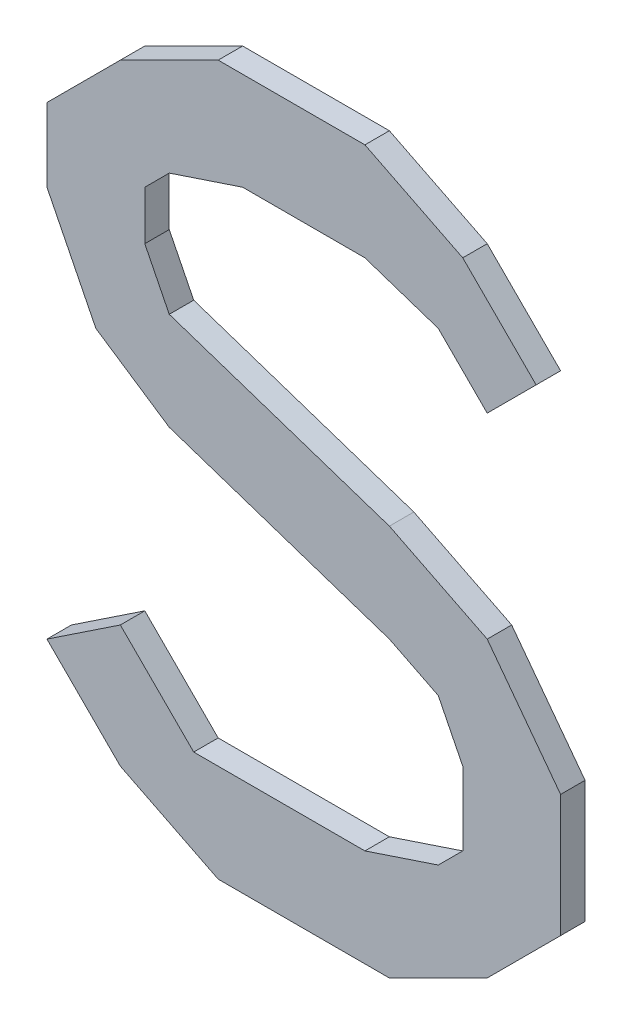
ISO-10303-21;
HEADER;
FILE_DESCRIPTION(('STEP AP214'),'2;1');
FILE_NAME('part.step','',(''),(''),'','','');
FILE_SCHEMA(('AUTOMOTIVE_DESIGN { 1 0 10303 214 1 1 1 1 }'));
ENDSEC;
DATA;
#1=APPLICATION_CONTEXT('core data for automotive mechanical design processes');
#2=APPLICATION_PROTOCOL_DEFINITION('international standard','automotive_design',2000,#1);
#3=PRODUCT_CONTEXT('',#1,'mechanical');
#4=PRODUCT('Part','Part','',(#3));
#5=PRODUCT_RELATED_PRODUCT_CATEGORY('part','',(#4));
#6=PRODUCT_DEFINITION_FORMATION('','',#4);
#7=PRODUCT_DEFINITION_CONTEXT('part definition',#1,'design');
#8=PRODUCT_DEFINITION('design','',#6,#7);
#9=PRODUCT_DEFINITION_SHAPE('','',#8);
#10=(LENGTH_UNIT() NAMED_UNIT(*) SI_UNIT(.MILLI.,.METRE.));
#11=(NAMED_UNIT(*) PLANE_ANGLE_UNIT() SI_UNIT($,.RADIAN.));
#12=(NAMED_UNIT(*) SI_UNIT($,.STERADIAN.) SOLID_ANGLE_UNIT());
#13=UNCERTAINTY_MEASURE_WITH_UNIT(LENGTH_MEASURE(1.E-05),#10,'distance_accuracy_value','');
#14=(GEOMETRIC_REPRESENTATION_CONTEXT(3) GLOBAL_UNCERTAINTY_ASSIGNED_CONTEXT((#13)) GLOBAL_UNIT_ASSIGNED_CONTEXT((#10,
#11,#12)) REPRESENTATION_CONTEXT('',''));
#15=CARTESIAN_POINT('',(0.,0.,0.));
#16=DIRECTION('',(0.,0.,1.));
#17=DIRECTION('',(1.,0.,0.));
#18=AXIS2_PLACEMENT_3D('',#15,#16,#17);
#19=CARTESIAN_POINT('',(0.07500112,0.07500112000001,0.));
#20=DIRECTION('',(0.,0.,-1.));
#21=DIRECTION('',(-1.,0.,0.));
#22=AXIS2_PLACEMENT_3D('',#19,#20,#21);
#23=PLANE('',#22);
#24=DIRECTION('',(0.707106781186548,-0.707106781186548,0.));
#25=VECTOR('',#24,1.);
#26=CARTESIAN_POINT('',(0.09500108,0.09500108,0.));
#27=LINE('',#26,#25);
#28=CARTESIAN_POINT('',(0.0650011400000088,0.125001019999999,0.));
#29=VERTEX_POINT('',#28);
#30=CARTESIAN_POINT('',(0.0950010800000023,0.0950010799999977,0.));
#31=VERTEX_POINT('',#30);
#32=EDGE_CURVE('E474',#29,#31,#27,.T.);
#33=ORIENTED_EDGE('',*,*,#32,.T.);
#34=DIRECTION('',(-0.707106781187048,-0.707106781186048,0.));
#35=VECTOR('',#34,1.);
#36=CARTESIAN_POINT('',(0.07500112,0.07500112000001,0.));
#37=LINE('',#36,#35);
#38=CARTESIAN_POINT('',(0.0750011199999975,0.0750011200000075,0.));
#39=VERTEX_POINT('',#38);
#40=EDGE_CURVE('E238',#31,#39,#37,.T.);
#41=ORIENTED_EDGE('',*,*,#40,.T.);
#42=DIRECTION('',(-0.707106781186548,0.707106781186548,0.));
#43=VECTOR('',#42,1.);
#44=CARTESIAN_POINT('',(0.05500116,0.09500108,0.));
#45=LINE('',#44,#43);
#46=CARTESIAN_POINT('',(0.05500116,0.0950010799999984,0.));
#47=VERTEX_POINT('',#46);
#48=EDGE_CURVE('E19',#39,#47,#45,.T.);
#49=ORIENTED_EDGE('',*,*,#48,.T.);
#50=DIRECTION('',(-0.948683298050414,0.316227766017138,0.));
#51=VECTOR('',#50,1.);
#52=CARTESIAN_POINT('',(0.02500122000001,0.10500106,0.));
#53=LINE('',#52,#51);
#54=CARTESIAN_POINT('',(0.02500122000001,0.10500106,0.));
#55=VERTEX_POINT('',#54);
#56=EDGE_CURVE('E235',#47,#55,#53,.T.);
#57=ORIENTED_EDGE('',*,*,#56,.T.);
#58=DIRECTION('',(1.,0.,0.));
#59=VECTOR('',#58,1.);
#60=CARTESIAN_POINT('',(-0.02499868,0.10500106,0.));
#61=LINE('',#60,#59);
#62=CARTESIAN_POINT('',(-0.0249986800000005,0.105001060000002,0.));
#63=VERTEX_POINT('',#62);
#64=EDGE_CURVE('E264',#55,#63,#61,.F.);
#65=ORIENTED_EDGE('',*,*,#64,.T.);
#66=DIRECTION('',(-0.948683298050414,-0.316227766017138,0.));
#67=VECTOR('',#66,1.);
#68=CARTESIAN_POINT('',(-0.05499861999999,0.09500108,0.));
#69=LINE('',#68,#67);
#70=CARTESIAN_POINT('',(-0.0549986199999913,0.0950010800000012,0.));
#71=VERTEX_POINT('',#70);
#72=EDGE_CURVE('E271',#63,#71,#69,.T.);
#73=ORIENTED_EDGE('',*,*,#72,.T.);
#74=DIRECTION('',(-0.707106781186548,-0.707106781186548,0.));
#75=VECTOR('',#74,1.);
#76=CARTESIAN_POINT('',(-0.0649986,0.0850011,0.));
#77=LINE('',#76,#75);
#78=CARTESIAN_POINT('',(-0.0649986,0.0850011,0.));
#79=VERTEX_POINT('',#78);
#80=EDGE_CURVE('E278',#71,#79,#77,.T.);
#81=ORIENTED_EDGE('',*,*,#80,.T.);
#82=DIRECTION('',(0.,1.,0.));
#83=VECTOR('',#82,1.);
#84=CARTESIAN_POINT('',(-0.0649986,0.06500114000001,0.));
#85=LINE('',#84,#83);
#86=CARTESIAN_POINT('',(-0.064998599999999,0.0650011400000105,0.));
#87=VERTEX_POINT('',#86);
#88=EDGE_CURVE('E285',#79,#87,#85,.F.);
#89=ORIENTED_EDGE('',*,*,#88,.T.);
#90=DIRECTION('',(0.447213595499958,-0.894427190999916,0.));
#91=VECTOR('',#90,1.);
#92=CARTESIAN_POINT('',(-0.05499861999999,0.04500118,0.));
#93=LINE('',#92,#91);
#94=CARTESIAN_POINT('',(-0.0549986199999903,0.0450011799999993,0.));
#95=VERTEX_POINT('',#94);
#96=EDGE_CURVE('E292',#87,#95,#93,.T.);
#97=ORIENTED_EDGE('',*,*,#96,.T.);
#98=DIRECTION('',(0.948683298050514,-0.316227766016838,0.));
#99=VECTOR('',#98,1.);
#100=CARTESIAN_POINT('',(0.0350012,0.01500124,0.));
#101=LINE('',#100,#99);
#102=CARTESIAN_POINT('',(0.0350012000000016,0.015001240000002,0.));
#103=VERTEX_POINT('',#102);
#104=EDGE_CURVE('E299',#95,#103,#101,.T.);
#105=ORIENTED_EDGE('',*,*,#104,.T.);
#106=DIRECTION('',(0.894427190999916,-0.447213595499958,0.));
#107=VECTOR('',#106,1.);
#108=CARTESIAN_POINT('',(0.07500112,-0.004998719999989,0.));
#109=LINE('',#108,#107);
#110=CARTESIAN_POINT('',(0.07500112,-0.00499871999998909,0.));
#111=VERTEX_POINT('',#110);
#112=EDGE_CURVE('E306',#103,#111,#109,.T.);
#113=ORIENTED_EDGE('',*,*,#112,.T.);
#114=DIRECTION('',(0.6,-0.8,0.));
#115=VECTOR('',#114,1.);
#116=CARTESIAN_POINT('',(0.10500106,-0.04499863999999,0.));
#117=LINE('',#116,#115);
#118=CARTESIAN_POINT('',(0.10500106,-0.04499863999999,0.));
#119=VERTEX_POINT('',#118);
#120=EDGE_CURVE('E313',#111,#119,#117,.T.);
#121=ORIENTED_EDGE('',*,*,#120,.T.);
#122=DIRECTION('',(0.,1.,0.));
#123=VECTOR('',#122,1.);
#124=CARTESIAN_POINT('',(0.10500106,-0.09499853999999,0.));
#125=LINE('',#124,#123);
#126=CARTESIAN_POINT('',(0.105001060000007,-0.0949985399999965,0.));
#127=VERTEX_POINT('',#126);
#128=EDGE_CURVE('E320',#119,#127,#125,.F.);
#129=ORIENTED_EDGE('',*,*,#128,.T.);
#130=DIRECTION('',(-0.707106781187048,-0.707106781186048,0.));
#131=VECTOR('',#130,1.);
#132=CARTESIAN_POINT('',(0.07500112,-0.12499848,0.));
#133=LINE('',#132,#131);
#134=CARTESIAN_POINT('',(0.07500112,-0.12499848,0.));
#135=VERTEX_POINT('',#134);
#136=EDGE_CURVE('E327',#127,#135,#133,.T.);
#137=ORIENTED_EDGE('',*,*,#136,.T.);
#138=DIRECTION('',(-0.894427190999916,-0.447213595499958,0.));
#139=VECTOR('',#138,1.);
#140=CARTESIAN_POINT('',(0.0350012,-0.14499844,0.));
#141=LINE('',#140,#139);
#142=CARTESIAN_POINT('',(0.0350012,-0.14499844,0.));
#143=VERTEX_POINT('',#142);
#144=EDGE_CURVE('E334',#135,#143,#141,.T.);
#145=ORIENTED_EDGE('',*,*,#144,.T.);
#146=DIRECTION('',(1.,0.,0.));
#147=VECTOR('',#146,1.);
#148=CARTESIAN_POINT('',(-0.03499866,-0.14499844,0.));
#149=LINE('',#148,#147);
#150=CARTESIAN_POINT('',(-0.03499866,-0.14499844,0.));
#151=VERTEX_POINT('',#150);
#152=EDGE_CURVE('E341',#143,#151,#149,.F.);
#153=ORIENTED_EDGE('',*,*,#152,.T.);
#154=DIRECTION('',(-0.894427190999916,0.447213595499958,0.));
#155=VECTOR('',#154,1.);
#156=CARTESIAN_POINT('',(-0.07499858,-0.12499848,0.));
#157=LINE('',#156,#155);
#158=CARTESIAN_POINT('',(-0.0749985799999988,-0.124998479999999,0.));
#159=VERTEX_POINT('',#158);
#160=EDGE_CURVE('E348',#151,#159,#157,.T.);
#161=ORIENTED_EDGE('',*,*,#160,.T.);
#162=DIRECTION('',(-0.707106781186548,0.707106781186548,0.));
#163=VECTOR('',#162,1.);
#164=CARTESIAN_POINT('',(-0.10499852,-0.09499853999999,0.));
#165=LINE('',#164,#163);
#166=CARTESIAN_POINT('',(-0.10499852,-0.0949985399999897,0.));
#167=VERTEX_POINT('',#166);
#168=EDGE_CURVE('E355',#159,#167,#165,.T.);
#169=ORIENTED_EDGE('',*,*,#168,.T.);
#170=DIRECTION('',(0.832050294337998,0.554700196224998,0.));
#171=VECTOR('',#170,1.);
#172=CARTESIAN_POINT('',(-0.07499858,-0.07499858,0.));
#173=LINE('',#172,#171);
#174=CARTESIAN_POINT('',(-0.07499858,-0.07499858,0.));
#175=VERTEX_POINT('',#174);
#176=EDGE_CURVE('E362',#167,#175,#173,.T.);
#177=ORIENTED_EDGE('',*,*,#176,.T.);
#178=DIRECTION('',(0.707106781186548,-0.707106781186548,0.));
#179=VECTOR('',#178,1.);
#180=CARTESIAN_POINT('',(-0.04499864,-0.10499852,0.));
#181=LINE('',#180,#179);
#182=CARTESIAN_POINT('',(-0.04499864,-0.10499852,0.));
#183=VERTEX_POINT('',#182);
#184=EDGE_CURVE('E369',#175,#183,#181,.T.);
#185=ORIENTED_EDGE('',*,*,#184,.T.);
#186=DIRECTION('',(1.,0.,0.));
#187=VECTOR('',#186,1.);
#188=CARTESIAN_POINT('',(0.02500122000001,-0.10499852,0.));
#189=LINE('',#188,#187);
#190=CARTESIAN_POINT('',(0.0250012200000098,-0.104998519999999,0.));
#191=VERTEX_POINT('',#190);
#192=EDGE_CURVE('E376',#183,#191,#189,.T.);
#193=ORIENTED_EDGE('',*,*,#192,.T.);
#194=DIRECTION('',(0.948683298050414,0.316227766017138,0.));
#195=VECTOR('',#194,1.);
#196=CARTESIAN_POINT('',(0.05500116,-0.09499853999999,0.));
#197=LINE('',#196,#195);
#198=CARTESIAN_POINT('',(0.0550011600000013,-0.0949985399999913,0.));
#199=VERTEX_POINT('',#198);
#200=EDGE_CURVE('E383',#191,#199,#197,.T.);
#201=ORIENTED_EDGE('',*,*,#200,.T.);
#202=DIRECTION('',(0.707106781186548,0.707106781186548,0.));
#203=VECTOR('',#202,1.);
#204=CARTESIAN_POINT('',(0.06500114000001,-0.08499855999999,0.));
#205=LINE('',#204,#203);
#206=CARTESIAN_POINT('',(0.06500114000001,-0.08499855999999,0.));
#207=VERTEX_POINT('',#206);
#208=EDGE_CURVE('E390',#199,#207,#205,.T.);
#209=ORIENTED_EDGE('',*,*,#208,.T.);
#210=DIRECTION('',(0.,1.,0.));
#211=VECTOR('',#210,1.);
#212=CARTESIAN_POINT('',(0.06500114000001,-0.05499861999999,0.));
#213=LINE('',#212,#211);
#214=CARTESIAN_POINT('',(0.065001140000007,-0.0549986199999915,0.));
#215=VERTEX_POINT('',#214);
#216=EDGE_CURVE('E397',#207,#215,#213,.T.);
#217=ORIENTED_EDGE('',*,*,#216,.T.);
#218=DIRECTION('',(-0.447213595499958,0.894427190999916,0.));
#219=VECTOR('',#218,1.);
#220=CARTESIAN_POINT('',(0.05500116,-0.03499866,0.));
#221=LINE('',#220,#219);
#222=CARTESIAN_POINT('',(0.05500116,-0.03499866,0.));
#223=VERTEX_POINT('',#222);
#224=EDGE_CURVE('E404',#215,#223,#221,.T.);
#225=ORIENTED_EDGE('',*,*,#224,.T.);
#226=DIRECTION('',(-0.894427190999916,0.447213595499958,0.));
#227=VECTOR('',#226,1.);
#228=CARTESIAN_POINT('',(0.0350012,-0.02499868,0.));
#229=LINE('',#228,#227);
#230=CARTESIAN_POINT('',(0.0350012,-0.0249986799999992,0.));
#231=VERTEX_POINT('',#230);
#232=EDGE_CURVE('E411',#223,#231,#229,.T.);
#233=ORIENTED_EDGE('',*,*,#232,.T.);
#234=DIRECTION('',(-0.948683298050514,0.316227766016838,0.));
#235=VECTOR('',#234,1.);
#236=CARTESIAN_POINT('',(-0.05499861999999,0.00500126,0.));
#237=LINE('',#236,#235);
#238=CARTESIAN_POINT('',(-0.0549986199999882,0.00500126000000266,0.));
#239=VERTEX_POINT('',#238);
#240=EDGE_CURVE('E418',#231,#239,#237,.T.);
#241=ORIENTED_EDGE('',*,*,#240,.T.);
#242=DIRECTION('',(-0.832050294337998,0.554700196224998,0.));
#243=VECTOR('',#242,1.);
#244=CARTESIAN_POINT('',(-0.08499856,0.02500122000001,0.));
#245=LINE('',#244,#243);
#246=CARTESIAN_POINT('',(-0.08499856,0.02500122000001,0.));
#247=VERTEX_POINT('',#246);
#248=EDGE_CURVE('E425',#239,#247,#245,.T.);
#249=ORIENTED_EDGE('',*,*,#248,.T.);
#250=DIRECTION('',(-0.447213595499958,0.894427190999916,0.));
#251=VECTOR('',#250,1.);
#252=CARTESIAN_POINT('',(-0.10499852,0.06500114000001,0.));
#253=LINE('',#252,#251);
#254=CARTESIAN_POINT('',(-0.10499852,0.06500114000001,0.));
#255=VERTEX_POINT('',#254);
#256=EDGE_CURVE('E432',#247,#255,#253,.T.);
#257=ORIENTED_EDGE('',*,*,#256,.T.);
#258=DIRECTION('',(0.,1.,0.));
#259=VECTOR('',#258,1.);
#260=CARTESIAN_POINT('',(-0.10499852,0.09500108,0.));
#261=LINE('',#260,#259);
#262=CARTESIAN_POINT('',(-0.10499852,0.09500108,0.));
#263=VERTEX_POINT('',#262);
#264=EDGE_CURVE('E439',#255,#263,#261,.T.);
#265=ORIENTED_EDGE('',*,*,#264,.T.);
#266=DIRECTION('',(0.707106781186548,0.707106781186548,0.));
#267=VECTOR('',#266,1.);
#268=CARTESIAN_POINT('',(-0.07499858,0.12500102,0.));
#269=LINE('',#268,#267);
#270=CARTESIAN_POINT('',(-0.07499858,0.12500102,0.));
#271=VERTEX_POINT('',#270);
#272=EDGE_CURVE('E446',#263,#271,#269,.T.);
#273=ORIENTED_EDGE('',*,*,#272,.T.);
#274=DIRECTION('',(0.894427190999916,0.447213595499958,0.));
#275=VECTOR('',#274,1.);
#276=CARTESIAN_POINT('',(-0.03499866,0.14500098,0.));
#277=LINE('',#276,#275);
#278=CARTESIAN_POINT('',(-0.03499866,0.14500098,0.));
#279=VERTEX_POINT('',#278);
#280=EDGE_CURVE('E453',#271,#279,#277,.T.);
#281=ORIENTED_EDGE('',*,*,#280,.T.);
#282=DIRECTION('',(1.,0.,0.));
#283=VECTOR('',#282,1.);
#284=CARTESIAN_POINT('',(0.02500122000001,0.14500098,0.));
#285=LINE('',#284,#283);
#286=CARTESIAN_POINT('',(0.02500122000001,0.14500098,0.));
#287=VERTEX_POINT('',#286);
#288=EDGE_CURVE('E460',#279,#287,#285,.T.);
#289=ORIENTED_EDGE('',*,*,#288,.T.);
#290=DIRECTION('',(0.894427190999916,-0.447213595499958,0.));
#291=VECTOR('',#290,1.);
#292=CARTESIAN_POINT('',(0.06500114000001,0.12500102,0.));
#293=LINE('',#292,#291);
#294=EDGE_CURVE('E467',#287,#29,#293,.T.);
#295=ORIENTED_EDGE('',*,*,#294,.T.);
#296=EDGE_LOOP('',(#33,#41,#49,#57,#65,#73,#81,#89,#97,#105,#113,#121,#129,#137,#145,#153,#161,
#169,#177,#185,#193,#201,#209,#217,#225,#233,#241,#249,#257,#265,#273,#281,#289,#295));
#297=FACE_BOUND('',#296,.T.);
#298=ADVANCED_FACE('F16',(#297),#23,.T.);
#299=CARTESIAN_POINT('',(0.05500116,0.09500108,0.));
#300=DIRECTION('',(0.707106781186548,0.707106781186548,0.));
#301=DIRECTION('',(-0.707106781186548,0.707106781186548,0.));
#302=AXIS2_PLACEMENT_3D('',#299,#300,#301);
#303=PLANE('',#302);
#304=DIRECTION('',(0.,0.,1.));
#305=VECTOR('',#304,1.);
#306=CARTESIAN_POINT('',(0.07500112,0.07500112000001,0.));
#307=LINE('',#306,#305);
#308=CARTESIAN_POINT('',(0.0750011199999975,0.0750011200000075,0.01));
#309=VERTEX_POINT('',#308);
#310=EDGE_CURVE('E477',#39,#309,#307,.T.);
#311=ORIENTED_EDGE('',*,*,#310,.T.);
#312=DIRECTION('',(-0.707106781186724,0.707106781186371,0.));
#313=VECTOR('',#312,1.);
#314=CARTESIAN_POINT('',(0.07500112,0.07500112000001,0.01));
#315=LINE('',#314,#313);
#316=CARTESIAN_POINT('',(0.05500116,0.0950010799999984,0.01));
#317=VERTEX_POINT('',#316);
#318=EDGE_CURVE('E255',#309,#317,#315,.T.);
#319=ORIENTED_EDGE('',*,*,#318,.T.);
#320=DIRECTION('',(0.,0.,1.));
#321=VECTOR('',#320,1.);
#322=CARTESIAN_POINT('',(0.0550011599999978,0.0950010799999935,0.));
#323=LINE('',#322,#321);
#324=EDGE_CURVE('E244',#317,#47,#323,.F.);
#325=ORIENTED_EDGE('',*,*,#324,.T.);
#326=ORIENTED_EDGE('',*,*,#48,.F.);
#327=EDGE_LOOP('',(#311,#319,#325,#326));
#328=FACE_BOUND('',#327,.T.);
#329=ADVANCED_FACE('F254',(#328),#303,.F.);
#330=CARTESIAN_POINT('',(0.02500122000001,0.10500106,0.));
#331=DIRECTION('',(0.316227766017138,0.948683298050414,0.));
#332=DIRECTION('',(-0.948683298050414,0.316227766017138,0.));
#333=AXIS2_PLACEMENT_3D('',#330,#331,#332);
#334=PLANE('',#333);
#335=ORIENTED_EDGE('',*,*,#324,.F.);
#336=DIRECTION('',(-0.948683298050482,0.316227766016933,0.));
#337=VECTOR('',#336,1.);
#338=CARTESIAN_POINT('',(0.05500116,0.09500108,0.01));
#339=LINE('',#338,#337);
#340=CARTESIAN_POINT('',(0.02500122000001,0.10500106,0.01));
#341=VERTEX_POINT('',#340);
#342=EDGE_CURVE('E486',#317,#341,#339,.T.);
#343=ORIENTED_EDGE('',*,*,#342,.T.);
#344=DIRECTION('',(0.,0.,1.));
#345=VECTOR('',#344,1.);
#346=CARTESIAN_POINT('',(0.02500122000001,0.10500106,0.));
#347=LINE('',#346,#345);
#348=EDGE_CURVE('E250',#341,#55,#347,.F.);
#349=ORIENTED_EDGE('',*,*,#348,.T.);
#350=ORIENTED_EDGE('',*,*,#56,.F.);
#351=EDGE_LOOP('',(#335,#343,#349,#350));
#352=FACE_BOUND('',#351,.T.);
#353=ADVANCED_FACE('F247',(#352),#334,.F.);
#354=CARTESIAN_POINT('',(-0.02499868,0.10500106,0.));
#355=DIRECTION('',(0.,1.,0.));
#356=DIRECTION('',(0.,0.,1.));
#357=AXIS2_PLACEMENT_3D('',#354,#355,#356);
#358=PLANE('',#357);
#359=ORIENTED_EDGE('',*,*,#348,.F.);
#360=DIRECTION('',(-1.,0.,0.));
#361=VECTOR('',#360,1.);
#362=CARTESIAN_POINT('',(0.07500112,0.10500106,0.01));
#363=LINE('',#362,#361);
#364=CARTESIAN_POINT('',(-0.0249986800000005,0.105001060000002,0.01));
#365=VERTEX_POINT('',#364);
#366=EDGE_CURVE('E489',#341,#365,#363,.T.);
#367=ORIENTED_EDGE('',*,*,#366,.T.);
#368=DIRECTION('',(0.,0.,1.));
#369=VECTOR('',#368,1.);
#370=CARTESIAN_POINT('',(-0.0249986800000022,0.105001060000006,0.));
#371=LINE('',#370,#369);
#372=EDGE_CURVE('E267',#365,#63,#371,.F.);
#373=ORIENTED_EDGE('',*,*,#372,.T.);
#374=ORIENTED_EDGE('',*,*,#64,.F.);
#375=EDGE_LOOP('',(#359,#367,#373,#374));
#376=FACE_BOUND('',#375,.T.);
#377=ADVANCED_FACE('F734',(#376),#358,.F.);
#378=CARTESIAN_POINT('',(-0.05499861999999,0.09500108,0.));
#379=DIRECTION('',(-0.316227766017138,0.948683298050414,0.));
#380=DIRECTION('',(-0.948683298050414,-0.316227766017138,0.));
#381=AXIS2_PLACEMENT_3D('',#378,#379,#380);
#382=PLANE('',#381);
#383=ORIENTED_EDGE('',*,*,#372,.F.);
#384=DIRECTION('',(-0.948683298050482,-0.316227766016933,0.));
#385=VECTOR('',#384,1.);
#386=CARTESIAN_POINT('',(-0.02499868,0.10500106,0.01));
#387=LINE('',#386,#385);
#388=CARTESIAN_POINT('',(-0.0549986199999913,0.0950010800000012,0.01));
#389=VERTEX_POINT('',#388);
#390=EDGE_CURVE('E493',#365,#389,#387,.T.);
#391=ORIENTED_EDGE('',*,*,#390,.T.);
#392=DIRECTION('',(0.,0.,1.));
#393=VECTOR('',#392,1.);
#394=CARTESIAN_POINT('',(-0.054998619999995,0.095001080000005,0.));
#395=LINE('',#394,#393);
#396=EDGE_CURVE('E274',#389,#71,#395,.F.);
#397=ORIENTED_EDGE('',*,*,#396,.T.);
#398=ORIENTED_EDGE('',*,*,#72,.F.);
#399=EDGE_LOOP('',(#383,#391,#397,#398));
#400=FACE_BOUND('',#399,.T.);
#401=ADVANCED_FACE('F731',(#400),#382,.F.);
#402=CARTESIAN_POINT('',(-0.0649986,0.0850011,0.));
#403=DIRECTION('',(-0.707106781186548,0.707106781186548,0.));
#404=DIRECTION('',(-0.707106781186548,-0.707106781186548,0.));
#405=AXIS2_PLACEMENT_3D('',#402,#403,#404);
#406=PLANE('',#405);
#407=ORIENTED_EDGE('',*,*,#396,.F.);
#408=DIRECTION('',(-0.707106781186902,-0.707106781186193,0.));
#409=VECTOR('',#408,1.);
#410=CARTESIAN_POINT('',(-0.05499861999999,0.09500108,0.01));
#411=LINE('',#410,#409);
#412=CARTESIAN_POINT('',(-0.0649986,0.0850011,0.01));
#413=VERTEX_POINT('',#412);
#414=EDGE_CURVE('E497',#389,#413,#411,.T.);
#415=ORIENTED_EDGE('',*,*,#414,.T.);
#416=DIRECTION('',(0.,0.,1.));
#417=VECTOR('',#416,1.);
#418=CARTESIAN_POINT('',(-0.0649986,0.0850011,0.));
#419=LINE('',#418,#417);
#420=EDGE_CURVE('E281',#413,#79,#419,.F.);
#421=ORIENTED_EDGE('',*,*,#420,.T.);
#422=ORIENTED_EDGE('',*,*,#80,.F.);
#423=EDGE_LOOP('',(#407,#415,#421,#422));
#424=FACE_BOUND('',#423,.T.);
#425=ADVANCED_FACE('F727',(#424),#406,.F.);
#426=CARTESIAN_POINT('',(-0.0649986,0.06500114000001,0.));
#427=DIRECTION('',(-1.,0.,0.));
#428=DIRECTION('',(0.,0.,1.));
#429=AXIS2_PLACEMENT_3D('',#426,#427,#428);
#430=PLANE('',#429);
#431=ORIENTED_EDGE('',*,*,#420,.F.);
#432=DIRECTION('',(0.,1.,0.));
#433=VECTOR('',#432,1.);
#434=CARTESIAN_POINT('',(-0.0649986,0.07500112000001,0.01));
#435=LINE('',#434,#433);
#436=CARTESIAN_POINT('',(-0.064998599999999,0.0650011400000105,0.01));
#437=VERTEX_POINT('',#436);
#438=EDGE_CURVE('E501',#413,#437,#435,.F.);
#439=ORIENTED_EDGE('',*,*,#438,.T.);
#440=DIRECTION('',(0.,0.,1.));
#441=VECTOR('',#440,1.);
#442=CARTESIAN_POINT('',(-0.064998599999996,0.065001140000012,0.));
#443=LINE('',#442,#441);
#444=EDGE_CURVE('E288',#437,#87,#443,.F.);
#445=ORIENTED_EDGE('',*,*,#444,.T.);
#446=ORIENTED_EDGE('',*,*,#88,.F.);
#447=EDGE_LOOP('',(#431,#439,#445,#446));
#448=FACE_BOUND('',#447,.T.);
#449=ADVANCED_FACE('F723',(#448),#430,.F.);
#450=CARTESIAN_POINT('',(-0.05499861999999,0.04500118,0.));
#451=DIRECTION('',(-0.894427190999916,-0.447213595499958,0.));
#452=DIRECTION('',(0.447213595499958,-0.894427190999916,0.));
#453=AXIS2_PLACEMENT_3D('',#450,#451,#452);
#454=PLANE('',#453);
#455=ORIENTED_EDGE('',*,*,#444,.F.);
#456=DIRECTION('',(0.447213595500138,-0.894427190999826,0.));
#457=VECTOR('',#456,1.);
#458=CARTESIAN_POINT('',(-0.0649986,0.06500114000001,0.01));
#459=LINE('',#458,#457);
#460=CARTESIAN_POINT('',(-0.0549986199999903,0.0450011799999993,0.01));
#461=VERTEX_POINT('',#460);
#462=EDGE_CURVE('E505',#437,#461,#459,.T.);
#463=ORIENTED_EDGE('',*,*,#462,.T.);
#464=DIRECTION('',(0.,0.,1.));
#465=VECTOR('',#464,1.);
#466=CARTESIAN_POINT('',(-0.054998619999991,0.045001179999997,0.));
#467=LINE('',#466,#465);
#468=EDGE_CURVE('E295',#461,#95,#467,.F.);
#469=ORIENTED_EDGE('',*,*,#468,.T.);
#470=ORIENTED_EDGE('',*,*,#96,.F.);
#471=EDGE_LOOP('',(#455,#463,#469,#470));
#472=FACE_BOUND('',#471,.T.);
#473=ADVANCED_FACE('F719',(#472),#454,.F.);
#474=CARTESIAN_POINT('',(0.0350012,0.01500124,0.));
#475=DIRECTION('',(-0.316227766016838,-0.948683298050514,0.));
#476=DIRECTION('',(0.948683298050514,-0.316227766016838,0.));
#477=AXIS2_PLACEMENT_3D('',#474,#475,#476);
#478=PLANE('',#477);
#479=ORIENTED_EDGE('',*,*,#468,.F.);
#480=DIRECTION('',(0.948683298050503,-0.31622776601687,0.));
#481=VECTOR('',#480,1.);
#482=CARTESIAN_POINT('',(-0.05499861999999,0.04500118,0.01));
#483=LINE('',#482,#481);
#484=CARTESIAN_POINT('',(0.0350012000000016,0.015001240000002,0.01));
#485=VERTEX_POINT('',#484);
#486=EDGE_CURVE('E509',#461,#485,#483,.T.);
#487=ORIENTED_EDGE('',*,*,#486,.T.);
#488=DIRECTION('',(0.,0.,1.));
#489=VECTOR('',#488,1.);
#490=CARTESIAN_POINT('',(0.0350012000000044,0.0150012400000088,0.));
#491=LINE('',#490,#489);
#492=EDGE_CURVE('E302',#485,#103,#491,.F.);
#493=ORIENTED_EDGE('',*,*,#492,.T.);
#494=ORIENTED_EDGE('',*,*,#104,.F.);
#495=EDGE_LOOP('',(#479,#487,#493,#494));
#496=FACE_BOUND('',#495,.T.);
#497=ADVANCED_FACE('F715',(#496),#478,.F.);
#498=CARTESIAN_POINT('',(0.07500112,-0.004998719999989,0.));
#499=DIRECTION('',(-0.447213595499958,-0.894427190999916,0.));
#500=DIRECTION('',(0.894427190999916,-0.447213595499958,0.));
#501=AXIS2_PLACEMENT_3D('',#498,#499,#500);
#502=PLANE('',#501);
#503=ORIENTED_EDGE('',*,*,#492,.F.);
#504=DIRECTION('',(0.894427191000014,-0.447213595499761,0.));
#505=VECTOR('',#504,1.);
#506=CARTESIAN_POINT('',(0.0350012,0.01500124,0.01));
#507=LINE('',#506,#505);
#508=CARTESIAN_POINT('',(0.07500112,-0.00499871999998909,0.01));
#509=VERTEX_POINT('',#508);
#510=EDGE_CURVE('E513',#485,#509,#507,.T.);
#511=ORIENTED_EDGE('',*,*,#510,.T.);
#512=DIRECTION('',(0.,0.,1.));
#513=VECTOR('',#512,1.);
#514=CARTESIAN_POINT('',(0.07500112,-0.00499871999998936,0.));
#515=LINE('',#514,#513);
#516=EDGE_CURVE('E309',#509,#111,#515,.F.);
#517=ORIENTED_EDGE('',*,*,#516,.T.);
#518=ORIENTED_EDGE('',*,*,#112,.F.);
#519=EDGE_LOOP('',(#503,#511,#517,#518));
#520=FACE_BOUND('',#519,.T.);
#521=ADVANCED_FACE('F711',(#520),#502,.F.);
#522=CARTESIAN_POINT('',(0.10500106,-0.04499863999999,0.));
#523=DIRECTION('',(-0.8,-0.6,0.));
#524=DIRECTION('',(0.6,-0.8,0.));
#525=AXIS2_PLACEMENT_3D('',#522,#523,#524);
#526=PLANE('',#525);
#527=ORIENTED_EDGE('',*,*,#516,.F.);
#528=DIRECTION('',(0.59999999999999,-0.8,0.));
#529=VECTOR('',#528,1.);
#530=CARTESIAN_POINT('',(0.07500112,-0.004998719999989,0.01));
#531=LINE('',#530,#529);
#532=CARTESIAN_POINT('',(0.10500106,-0.04499863999999,0.01));
#533=VERTEX_POINT('',#532);
#534=EDGE_CURVE('E517',#509,#533,#531,.T.);
#535=ORIENTED_EDGE('',*,*,#534,.T.);
#536=DIRECTION('',(0.,0.,1.));
#537=VECTOR('',#536,1.);
#538=CARTESIAN_POINT('',(0.10500106,-0.04499863999999,0.));
#539=LINE('',#538,#537);
#540=EDGE_CURVE('E316',#533,#119,#539,.F.);
#541=ORIENTED_EDGE('',*,*,#540,.T.);
#542=ORIENTED_EDGE('',*,*,#120,.F.);
#543=EDGE_LOOP('',(#527,#535,#541,#542));
#544=FACE_BOUND('',#543,.T.);
#545=ADVANCED_FACE('F707',(#544),#526,.F.);
#546=CARTESIAN_POINT('',(0.10500106,-0.09499853999999,0.));
#547=DIRECTION('',(-1.,0.,0.));
#548=DIRECTION('',(0.,0.,1.));
#549=AXIS2_PLACEMENT_3D('',#546,#547,#548);
#550=PLANE('',#549);
#551=ORIENTED_EDGE('',*,*,#540,.F.);
#552=DIRECTION('',(0.,1.,0.));
#553=VECTOR('',#552,1.);
#554=CARTESIAN_POINT('',(0.10500106,0.07500112000001,0.01));
#555=LINE('',#554,#553);
#556=CARTESIAN_POINT('',(0.105001060000007,-0.0949985399999965,0.01));
#557=VERTEX_POINT('',#556);
#558=EDGE_CURVE('E521',#533,#557,#555,.F.);
#559=ORIENTED_EDGE('',*,*,#558,.T.);
#560=DIRECTION('',(0.,0.,1.));
#561=VECTOR('',#560,1.);
#562=CARTESIAN_POINT('',(0.105001060000026,-0.0949985400000162,0.));
#563=LINE('',#562,#561);
#564=EDGE_CURVE('E323',#557,#127,#563,.F.);
#565=ORIENTED_EDGE('',*,*,#564,.T.);
#566=ORIENTED_EDGE('',*,*,#128,.F.);
#567=EDGE_LOOP('',(#551,#559,#565,#566));
#568=FACE_BOUND('',#567,.T.);
#569=ADVANCED_FACE('F703',(#568),#550,.F.);
#570=CARTESIAN_POINT('',(0.07500112,-0.12499848,0.));
#571=DIRECTION('',(-0.707106781186048,0.707106781187048,0.));
#572=DIRECTION('',(-0.707106781187048,-0.707106781186048,0.));
#573=AXIS2_PLACEMENT_3D('',#570,#571,#572);
#574=PLANE('',#573);
#575=ORIENTED_EDGE('',*,*,#564,.F.);
#576=DIRECTION('',(-0.70710678118643,-0.707106781186666,0.));
#577=VECTOR('',#576,1.);
#578=CARTESIAN_POINT('',(0.10500106,-0.09499853999999,0.01));
#579=LINE('',#578,#577);
#580=CARTESIAN_POINT('',(0.07500112,-0.12499848,0.01));
#581=VERTEX_POINT('',#580);
#582=EDGE_CURVE('E525',#557,#581,#579,.T.);
#583=ORIENTED_EDGE('',*,*,#582,.T.);
#584=DIRECTION('',(0.,0.,1.));
#585=VECTOR('',#584,1.);
#586=CARTESIAN_POINT('',(0.07500112,-0.12499848,0.));
#587=LINE('',#586,#585);
#588=EDGE_CURVE('E330',#581,#135,#587,.F.);
#589=ORIENTED_EDGE('',*,*,#588,.T.);
#590=ORIENTED_EDGE('',*,*,#136,.F.);
#591=EDGE_LOOP('',(#575,#583,#589,#590));
#592=FACE_BOUND('',#591,.T.);
#593=ADVANCED_FACE('F699',(#592),#574,.F.);
#594=CARTESIAN_POINT('',(0.0350012,-0.14499844,0.));
#595=DIRECTION('',(-0.447213595499958,0.894427190999916,0.));
#596=DIRECTION('',(-0.894427190999916,-0.447213595499958,0.));
#597=AXIS2_PLACEMENT_3D('',#594,#595,#596);
#598=PLANE('',#597);
#599=ORIENTED_EDGE('',*,*,#588,.F.);
#600=DIRECTION('',(-0.894427190999916,-0.447213595499958,0.));
#601=VECTOR('',#600,1.);
#602=CARTESIAN_POINT('',(0.07500112,-0.12499848,0.01));
#603=LINE('',#602,#601);
#604=CARTESIAN_POINT('',(0.0350012,-0.14499844,0.01));
#605=VERTEX_POINT('',#604);
#606=EDGE_CURVE('E529',#581,#605,#603,.T.);
#607=ORIENTED_EDGE('',*,*,#606,.T.);
#608=DIRECTION('',(0.,0.,1.));
#609=VECTOR('',#608,1.);
#610=CARTESIAN_POINT('',(0.0350012,-0.14499844,0.));
#611=LINE('',#610,#609);
#612=EDGE_CURVE('E337',#605,#143,#611,.F.);
#613=ORIENTED_EDGE('',*,*,#612,.T.);
#614=ORIENTED_EDGE('',*,*,#144,.F.);
#615=EDGE_LOOP('',(#599,#607,#613,#614));
#616=FACE_BOUND('',#615,.T.);
#617=ADVANCED_FACE('F695',(#616),#598,.F.);
#618=CARTESIAN_POINT('',(-0.03499866,-0.14499844,0.));
#619=DIRECTION('',(0.,1.,0.));
#620=DIRECTION('',(0.,0.,1.));
#621=AXIS2_PLACEMENT_3D('',#618,#619,#620);
#622=PLANE('',#621);
#623=ORIENTED_EDGE('',*,*,#612,.F.);
#624=DIRECTION('',(-1.,0.,0.));
#625=VECTOR('',#624,1.);
#626=CARTESIAN_POINT('',(0.07500112,-0.14499844,0.01));
#627=LINE('',#626,#625);
#628=CARTESIAN_POINT('',(-0.03499866,-0.14499844,0.01));
#629=VERTEX_POINT('',#628);
#630=EDGE_CURVE('E533',#605,#629,#627,.T.);
#631=ORIENTED_EDGE('',*,*,#630,.T.);
#632=DIRECTION('',(0.,0.,1.));
#633=VECTOR('',#632,1.);
#634=CARTESIAN_POINT('',(-0.03499866,-0.14499844,0.));
#635=LINE('',#634,#633);
#636=EDGE_CURVE('E344',#629,#151,#635,.F.);
#637=ORIENTED_EDGE('',*,*,#636,.T.);
#638=ORIENTED_EDGE('',*,*,#152,.F.);
#639=EDGE_LOOP('',(#623,#631,#637,#638));
#640=FACE_BOUND('',#639,.T.);
#641=ADVANCED_FACE('F691',(#640),#622,.F.);
#642=CARTESIAN_POINT('',(-0.07499858,-0.12499848,0.));
#643=DIRECTION('',(0.447213595499958,0.894427190999916,0.));
#644=DIRECTION('',(-0.894427190999916,0.447213595499958,0.));
#645=AXIS2_PLACEMENT_3D('',#642,#643,#644);
#646=PLANE('',#645);
#647=ORIENTED_EDGE('',*,*,#636,.F.);
#648=DIRECTION('',(-0.894427190999916,0.447213595499958,0.));
#649=VECTOR('',#648,1.);
#650=CARTESIAN_POINT('',(-0.03499866,-0.14499844,0.01));
#651=LINE('',#650,#649);
#652=CARTESIAN_POINT('',(-0.0749985799999988,-0.124998479999999,0.01));
#653=VERTEX_POINT('',#652);
#654=EDGE_CURVE('E537',#629,#653,#651,.T.);
#655=ORIENTED_EDGE('',*,*,#654,.T.);
#656=DIRECTION('',(0.,0.,1.));
#657=VECTOR('',#656,1.);
#658=CARTESIAN_POINT('',(-0.074998579999995,-0.124998479999995,0.));
#659=LINE('',#658,#657);
#660=EDGE_CURVE('E351',#653,#159,#659,.F.);
#661=ORIENTED_EDGE('',*,*,#660,.T.);
#662=ORIENTED_EDGE('',*,*,#160,.F.);
#663=EDGE_LOOP('',(#647,#655,#661,#662));
#664=FACE_BOUND('',#663,.T.);
#665=ADVANCED_FACE('F687',(#664),#646,.F.);
#666=CARTESIAN_POINT('',(-0.10499852,-0.09499853999999,0.));
#667=DIRECTION('',(0.707106781186548,0.707106781186548,0.));
#668=DIRECTION('',(-0.707106781186548,0.707106781186548,0.));
#669=AXIS2_PLACEMENT_3D('',#666,#667,#668);
#670=PLANE('',#669);
#671=ORIENTED_EDGE('',*,*,#660,.F.);
#672=DIRECTION('',(-0.70710678118643,0.707106781186666,0.));
#673=VECTOR('',#672,1.);
#674=CARTESIAN_POINT('',(-0.07499858,-0.12499848,0.01));
#675=LINE('',#674,#673);
#676=CARTESIAN_POINT('',(-0.10499852,-0.0949985399999897,0.01));
#677=VERTEX_POINT('',#676);
#678=EDGE_CURVE('E541',#653,#677,#675,.T.);
#679=ORIENTED_EDGE('',*,*,#678,.T.);
#680=DIRECTION('',(0.,0.,1.));
#681=VECTOR('',#680,1.);
#682=CARTESIAN_POINT('',(-0.104998520000001,-0.0949985399999886,0.));
#683=LINE('',#682,#681);
#684=EDGE_CURVE('E358',#677,#167,#683,.F.);
#685=ORIENTED_EDGE('',*,*,#684,.T.);
#686=ORIENTED_EDGE('',*,*,#168,.F.);
#687=EDGE_LOOP('',(#671,#679,#685,#686));
#688=FACE_BOUND('',#687,.T.);
#689=ADVANCED_FACE('F683',(#688),#670,.F.);
#690=CARTESIAN_POINT('',(-0.07499858,-0.07499858,0.));
#691=DIRECTION('',(0.554700196224998,-0.832050294337998,0.));
#692=DIRECTION('',(0.832050294337998,0.554700196224998,0.));
#693=AXIS2_PLACEMENT_3D('',#690,#691,#692);
#694=PLANE('',#693);
#695=ORIENTED_EDGE('',*,*,#684,.F.);
#696=DIRECTION('',(0.832050294337972,0.554700196225037,0.));
#697=VECTOR('',#696,1.);
#698=CARTESIAN_POINT('',(-0.10499852,-0.09499853999999,0.01));
#699=LINE('',#698,#697);
#700=CARTESIAN_POINT('',(-0.07499858,-0.07499858,0.01));
#701=VERTEX_POINT('',#700);
#702=EDGE_CURVE('E545',#677,#701,#699,.T.);
#703=ORIENTED_EDGE('',*,*,#702,.T.);
#704=DIRECTION('',(0.,0.,1.));
#705=VECTOR('',#704,1.);
#706=CARTESIAN_POINT('',(-0.07499858,-0.07499858,0.));
#707=LINE('',#706,#705);
#708=EDGE_CURVE('E365',#701,#175,#707,.F.);
#709=ORIENTED_EDGE('',*,*,#708,.T.);
#710=ORIENTED_EDGE('',*,*,#176,.F.);
#711=EDGE_LOOP('',(#695,#703,#709,#710));
#712=FACE_BOUND('',#711,.T.);
#713=ADVANCED_FACE('F679',(#712),#694,.F.);
#714=CARTESIAN_POINT('',(-0.04499864,-0.10499852,0.));
#715=DIRECTION('',(-0.707106781186548,-0.707106781186548,0.));
#716=DIRECTION('',(0.707106781186548,-0.707106781186548,0.));
#717=AXIS2_PLACEMENT_3D('',#714,#715,#716);
#718=PLANE('',#717);
#719=ORIENTED_EDGE('',*,*,#708,.F.);
#720=DIRECTION('',(0.707106781186548,-0.707106781186547,0.));
#721=VECTOR('',#720,1.);
#722=CARTESIAN_POINT('',(-0.07499858,-0.07499858,0.01));
#723=LINE('',#722,#721);
#724=CARTESIAN_POINT('',(-0.04499864,-0.10499852,0.01));
#725=VERTEX_POINT('',#724);
#726=EDGE_CURVE('E549',#701,#725,#723,.T.);
#727=ORIENTED_EDGE('',*,*,#726,.T.);
#728=DIRECTION('',(0.,0.,-1.));
#729=VECTOR('',#728,1.);
#730=CARTESIAN_POINT('',(-0.04499864,-0.10499852,0.));
#731=LINE('',#730,#729);
#732=EDGE_CURVE('E372',#725,#183,#731,.T.);
#733=ORIENTED_EDGE('',*,*,#732,.T.);
#734=ORIENTED_EDGE('',*,*,#184,.F.);
#735=EDGE_LOOP('',(#719,#727,#733,#734));
#736=FACE_BOUND('',#735,.T.);
#737=ADVANCED_FACE('F675',(#736),#718,.F.);
#738=CARTESIAN_POINT('',(0.02500122000001,-0.10499852,0.));
#739=DIRECTION('',(0.,-1.,0.));
#740=DIRECTION('',(0.,0.,-1.));
#741=AXIS2_PLACEMENT_3D('',#738,#739,#740);
#742=PLANE('',#741);
#743=ORIENTED_EDGE('',*,*,#732,.F.);
#744=DIRECTION('',(-1.,0.,0.));
#745=VECTOR('',#744,1.);
#746=CARTESIAN_POINT('',(0.07500112,-0.10499852,0.01));
#747=LINE('',#746,#745);
#748=CARTESIAN_POINT('',(0.0250012200000098,-0.104998519999999,0.01));
#749=VERTEX_POINT('',#748);
#750=EDGE_CURVE('E553',#725,#749,#747,.F.);
#751=ORIENTED_EDGE('',*,*,#750,.T.);
#752=DIRECTION('',(0.,0.,1.));
#753=VECTOR('',#752,1.);
#754=CARTESIAN_POINT('',(0.0250012200000092,-0.104998519999997,0.));
#755=LINE('',#754,#753);
#756=EDGE_CURVE('E379',#749,#191,#755,.F.);
#757=ORIENTED_EDGE('',*,*,#756,.T.);
#758=ORIENTED_EDGE('',*,*,#192,.F.);
#759=EDGE_LOOP('',(#743,#751,#757,#758));
#760=FACE_BOUND('',#759,.T.);
#761=ADVANCED_FACE('F671',(#760),#742,.F.);
#762=CARTESIAN_POINT('',(0.05500116,-0.09499853999999,0.));
#763=DIRECTION('',(0.316227766017138,-0.948683298050414,0.));
#764=DIRECTION('',(0.948683298050414,0.316227766017138,0.));
#765=AXIS2_PLACEMENT_3D('',#762,#763,#764);
#766=PLANE('',#765);
#767=ORIENTED_EDGE('',*,*,#756,.F.);
#768=DIRECTION('',(0.948683298050387,0.316227766017218,0.));
#769=VECTOR('',#768,1.);
#770=CARTESIAN_POINT('',(0.02500122000001,-0.10499852,0.01));
#771=LINE('',#770,#769);
#772=CARTESIAN_POINT('',(0.0550011600000013,-0.0949985399999913,0.01));
#773=VERTEX_POINT('',#772);
#774=EDGE_CURVE('E557',#749,#773,#771,.T.);
#775=ORIENTED_EDGE('',*,*,#774,.T.);
#776=DIRECTION('',(0.,0.,1.));
#777=VECTOR('',#776,1.);
#778=CARTESIAN_POINT('',(0.055001160000005,-0.094998539999995,0.));
#779=LINE('',#778,#777);
#780=EDGE_CURVE('E386',#773,#199,#779,.F.);
#781=ORIENTED_EDGE('',*,*,#780,.T.);
#782=ORIENTED_EDGE('',*,*,#200,.F.);
#783=EDGE_LOOP('',(#767,#775,#781,#782));
#784=FACE_BOUND('',#783,.T.);
#785=ADVANCED_FACE('F667',(#784),#766,.F.);
#786=CARTESIAN_POINT('',(0.06500114000001,-0.08499855999999,0.));
#787=DIRECTION('',(0.707106781186548,-0.707106781186548,0.));
#788=DIRECTION('',(0.707106781186548,0.707106781186548,0.));
#789=AXIS2_PLACEMENT_3D('',#786,#787,#788);
#790=PLANE('',#789);
#791=ORIENTED_EDGE('',*,*,#780,.F.);
#792=DIRECTION('',(0.707106781186901,0.707106781186194,0.));
#793=VECTOR('',#792,1.);
#794=CARTESIAN_POINT('',(0.05500116,-0.09499853999999,0.01));
#795=LINE('',#794,#793);
#796=CARTESIAN_POINT('',(0.06500114000001,-0.08499855999999,0.01));
#797=VERTEX_POINT('',#796);
#798=EDGE_CURVE('E560',#773,#797,#795,.T.);
#799=ORIENTED_EDGE('',*,*,#798,.T.);
#800=DIRECTION('',(0.,0.,-1.));
#801=VECTOR('',#800,1.);
#802=CARTESIAN_POINT('',(0.06500114000001,-0.08499855999999,0.));
#803=LINE('',#802,#801);
#804=EDGE_CURVE('E393',#797,#207,#803,.T.);
#805=ORIENTED_EDGE('',*,*,#804,.T.);
#806=ORIENTED_EDGE('',*,*,#208,.F.);
#807=EDGE_LOOP('',(#791,#799,#805,#806));
#808=FACE_BOUND('',#807,.T.);
#809=ADVANCED_FACE('F663',(#808),#790,.F.);
#810=CARTESIAN_POINT('',(0.06500114000001,-0.05499861999999,0.));
#811=DIRECTION('',(1.,0.,0.));
#812=DIRECTION('',(0.,0.,-1.));
#813=AXIS2_PLACEMENT_3D('',#810,#811,#812);
#814=PLANE('',#813);
#815=ORIENTED_EDGE('',*,*,#804,.F.);
#816=DIRECTION('',(0.,1.,0.));
#817=VECTOR('',#816,1.);
#818=CARTESIAN_POINT('',(0.06500114000001,0.07500112000001,0.01));
#819=LINE('',#818,#817);
#820=CARTESIAN_POINT('',(0.065001140000007,-0.0549986199999915,0.01));
#821=VERTEX_POINT('',#820);
#822=EDGE_CURVE('E564',#797,#821,#819,.T.);
#823=ORIENTED_EDGE('',*,*,#822,.T.);
#824=DIRECTION('',(0.,0.,1.));
#825=VECTOR('',#824,1.);
#826=CARTESIAN_POINT('',(0.065001139999998,-0.054998619999996,0.));
#827=LINE('',#826,#825);
#828=EDGE_CURVE('E400',#821,#215,#827,.F.);
#829=ORIENTED_EDGE('',*,*,#828,.T.);
#830=ORIENTED_EDGE('',*,*,#216,.F.);
#831=EDGE_LOOP('',(#815,#823,#829,#830));
#832=FACE_BOUND('',#831,.T.);
#833=ADVANCED_FACE('F659',(#832),#814,.F.);
#834=CARTESIAN_POINT('',(0.05500116,-0.03499866,0.));
#835=DIRECTION('',(0.894427190999916,0.447213595499958,0.));
#836=DIRECTION('',(-0.447213595499958,0.894427190999916,0.));
#837=AXIS2_PLACEMENT_3D('',#834,#835,#836);
#838=PLANE('',#837);
#839=ORIENTED_EDGE('',*,*,#828,.F.);
#840=DIRECTION('',(-0.447213595500495,0.894427190999647,0.));
#841=VECTOR('',#840,1.);
#842=CARTESIAN_POINT('',(0.06500114000001,-0.05499861999999,0.01));
#843=LINE('',#842,#841);
#844=CARTESIAN_POINT('',(0.05500116,-0.03499866,0.01));
#845=VERTEX_POINT('',#844);
#846=EDGE_CURVE('E568',#821,#845,#843,.T.);
#847=ORIENTED_EDGE('',*,*,#846,.T.);
#848=DIRECTION('',(0.,0.,1.));
#849=VECTOR('',#848,1.);
#850=CARTESIAN_POINT('',(0.05500116,-0.03499866,0.));
#851=LINE('',#850,#849);
#852=EDGE_CURVE('E407',#845,#223,#851,.F.);
#853=ORIENTED_EDGE('',*,*,#852,.T.);
#854=ORIENTED_EDGE('',*,*,#224,.F.);
#855=EDGE_LOOP('',(#839,#847,#853,#854));
#856=FACE_BOUND('',#855,.T.);
#857=ADVANCED_FACE('F655',(#856),#838,.F.);
#858=CARTESIAN_POINT('',(0.0350012,-0.02499868,0.));
#859=DIRECTION('',(0.447213595499958,0.894427190999916,0.));
#860=DIRECTION('',(-0.894427190999916,0.447213595499958,0.));
#861=AXIS2_PLACEMENT_3D('',#858,#859,#860);
#862=PLANE('',#861);
#863=ORIENTED_EDGE('',*,*,#852,.F.);
#864=DIRECTION('',(-0.894427190999916,0.447213595499959,0.));
#865=VECTOR('',#864,1.);
#866=CARTESIAN_POINT('',(0.05500116,-0.03499866,0.01));
#867=LINE('',#866,#865);
#868=CARTESIAN_POINT('',(0.0350012,-0.0249986799999992,0.01));
#869=VERTEX_POINT('',#868);
#870=EDGE_CURVE('E572',#845,#869,#867,.T.);
#871=ORIENTED_EDGE('',*,*,#870,.T.);
#872=DIRECTION('',(0.,0.,1.));
#873=VECTOR('',#872,1.);
#874=CARTESIAN_POINT('',(0.0350012000000011,-0.024998679999997,0.));
#875=LINE('',#874,#873);
#876=EDGE_CURVE('E414',#869,#231,#875,.F.);
#877=ORIENTED_EDGE('',*,*,#876,.T.);
#878=ORIENTED_EDGE('',*,*,#232,.F.);
#879=EDGE_LOOP('',(#863,#871,#877,#878));
#880=FACE_BOUND('',#879,.T.);
#881=ADVANCED_FACE('F651',(#880),#862,.F.);
#882=CARTESIAN_POINT('',(-0.05499861999999,0.00500126,0.));
#883=DIRECTION('',(0.316227766016838,0.948683298050514,0.));
#884=DIRECTION('',(-0.948683298050514,0.316227766016838,0.));
#885=AXIS2_PLACEMENT_3D('',#882,#883,#884);
#886=PLANE('',#885);
#887=ORIENTED_EDGE('',*,*,#876,.F.);
#888=DIRECTION('',(-0.948683298050503,0.31622776601687,0.));
#889=VECTOR('',#888,1.);
#890=CARTESIAN_POINT('',(0.0350012,-0.02499868,0.01));
#891=LINE('',#890,#889);
#892=CARTESIAN_POINT('',(-0.0549986199999882,0.00500126000000266,0.01));
#893=VERTEX_POINT('',#892);
#894=EDGE_CURVE('E576',#869,#893,#891,.T.);
#895=ORIENTED_EDGE('',*,*,#894,.T.);
#896=DIRECTION('',(0.,0.,1.));
#897=VECTOR('',#896,1.);
#898=CARTESIAN_POINT('',(-0.0549986199999829,0.00500126000001063,0.));
#899=LINE('',#898,#897);
#900=EDGE_CURVE('E421',#893,#239,#899,.F.);
#901=ORIENTED_EDGE('',*,*,#900,.T.);
#902=ORIENTED_EDGE('',*,*,#240,.F.);
#903=EDGE_LOOP('',(#887,#895,#901,#902));
#904=FACE_BOUND('',#903,.T.);
#905=ADVANCED_FACE('F647',(#904),#886,.F.);
#906=CARTESIAN_POINT('',(-0.08499856,0.02500122000001,0.));
#907=DIRECTION('',(0.554700196224998,0.832050294337998,0.));
#908=DIRECTION('',(-0.832050294337998,0.554700196224998,0.));
#909=AXIS2_PLACEMENT_3D('',#906,#907,#908);
#910=PLANE('',#909);
#911=ORIENTED_EDGE('',*,*,#900,.F.);
#912=DIRECTION('',(-0.832050294337801,0.554700196225293,0.));
#913=VECTOR('',#912,1.);
#914=CARTESIAN_POINT('',(-0.05499861999999,0.00500126,0.01));
#915=LINE('',#914,#913);
#916=CARTESIAN_POINT('',(-0.08499856,0.02500122000001,0.01));
#917=VERTEX_POINT('',#916);
#918=EDGE_CURVE('E580',#893,#917,#915,.T.);
#919=ORIENTED_EDGE('',*,*,#918,.T.);
#920=DIRECTION('',(0.,0.,1.));
#921=VECTOR('',#920,1.);
#922=CARTESIAN_POINT('',(-0.08499856,0.02500122000001,0.));
#923=LINE('',#922,#921);
#924=EDGE_CURVE('E428',#917,#247,#923,.F.);
#925=ORIENTED_EDGE('',*,*,#924,.T.);
#926=ORIENTED_EDGE('',*,*,#248,.F.);
#927=EDGE_LOOP('',(#911,#919,#925,#926));
#928=FACE_BOUND('',#927,.T.);
#929=ADVANCED_FACE('F643',(#928),#910,.F.);
#930=CARTESIAN_POINT('',(-0.10499852,0.06500114000001,0.));
#931=DIRECTION('',(0.894427190999916,0.447213595499958,0.));
#932=DIRECTION('',(-0.447213595499958,0.894427190999916,0.));
#933=AXIS2_PLACEMENT_3D('',#930,#931,#932);
#934=PLANE('',#933);
#935=ORIENTED_EDGE('',*,*,#924,.F.);
#936=DIRECTION('',(-0.447213595499958,0.894427190999916,0.));
#937=VECTOR('',#936,1.);
#938=CARTESIAN_POINT('',(-0.08499856,0.02500122000001,0.01));
#939=LINE('',#938,#937);
#940=CARTESIAN_POINT('',(-0.10499852,0.06500114000001,0.01));
#941=VERTEX_POINT('',#940);
#942=EDGE_CURVE('E584',#917,#941,#939,.T.);
#943=ORIENTED_EDGE('',*,*,#942,.T.);
#944=DIRECTION('',(0.,0.,-1.));
#945=VECTOR('',#944,1.);
#946=CARTESIAN_POINT('',(-0.10499852,0.06500114000001,0.));
#947=LINE('',#946,#945);
#948=EDGE_CURVE('E435',#941,#255,#947,.T.);
#949=ORIENTED_EDGE('',*,*,#948,.T.);
#950=ORIENTED_EDGE('',*,*,#256,.F.);
#951=EDGE_LOOP('',(#935,#943,#949,#950));
#952=FACE_BOUND('',#951,.T.);
#953=ADVANCED_FACE('F639',(#952),#934,.F.);
#954=CARTESIAN_POINT('',(-0.10499852,0.09500108,0.));
#955=DIRECTION('',(1.,0.,0.));
#956=DIRECTION('',(0.,0.,-1.));
#957=AXIS2_PLACEMENT_3D('',#954,#955,#956);
#958=PLANE('',#957);
#959=ORIENTED_EDGE('',*,*,#948,.F.);
#960=DIRECTION('',(0.,1.,0.));
#961=VECTOR('',#960,1.);
#962=CARTESIAN_POINT('',(-0.10499852,0.07500112000001,0.01));
#963=LINE('',#962,#961);
#964=CARTESIAN_POINT('',(-0.10499852,0.09500108,0.01));
#965=VERTEX_POINT('',#964);
#966=EDGE_CURVE('E587',#941,#965,#963,.T.);
#967=ORIENTED_EDGE('',*,*,#966,.T.);
#968=DIRECTION('',(0.,0.,1.));
#969=VECTOR('',#968,1.);
#970=CARTESIAN_POINT('',(-0.10499852,0.09500108,0.));
#971=LINE('',#970,#969);
#972=EDGE_CURVE('E442',#965,#263,#971,.F.);
#973=ORIENTED_EDGE('',*,*,#972,.T.);
#974=ORIENTED_EDGE('',*,*,#264,.F.);
#975=EDGE_LOOP('',(#959,#967,#973,#974));
#976=FACE_BOUND('',#975,.T.);
#977=ADVANCED_FACE('F635',(#976),#958,.F.);
#978=CARTESIAN_POINT('',(-0.07499858,0.12500102,0.));
#979=DIRECTION('',(0.707106781186548,-0.707106781186548,0.));
#980=DIRECTION('',(0.707106781186548,0.707106781186548,0.));
#981=AXIS2_PLACEMENT_3D('',#978,#979,#980);
#982=PLANE('',#981);
#983=ORIENTED_EDGE('',*,*,#972,.F.);
#984=DIRECTION('',(0.707106781186548,0.707106781186548,0.));
#985=VECTOR('',#984,1.);
#986=CARTESIAN_POINT('',(-0.10499852,0.09500108,0.01));
#987=LINE('',#986,#985);
#988=CARTESIAN_POINT('',(-0.07499858,0.12500102,0.01));
#989=VERTEX_POINT('',#988);
#990=EDGE_CURVE('E591',#965,#989,#987,.T.);
#991=ORIENTED_EDGE('',*,*,#990,.T.);
#992=DIRECTION('',(0.,0.,1.));
#993=VECTOR('',#992,1.);
#994=CARTESIAN_POINT('',(-0.07499858,0.12500102,0.));
#995=LINE('',#994,#993);
#996=EDGE_CURVE('E449',#989,#271,#995,.F.);
#997=ORIENTED_EDGE('',*,*,#996,.T.);
#998=ORIENTED_EDGE('',*,*,#272,.F.);
#999=EDGE_LOOP('',(#983,#991,#997,#998));
#1000=FACE_BOUND('',#999,.T.);
#1001=ADVANCED_FACE('F631',(#1000),#982,.F.);
#1002=CARTESIAN_POINT('',(-0.03499866,0.14500098,0.));
#1003=DIRECTION('',(0.447213595499958,-0.894427190999916,0.));
#1004=DIRECTION('',(0.894427190999916,0.447213595499958,0.));
#1005=AXIS2_PLACEMENT_3D('',#1002,#1003,#1004);
#1006=PLANE('',#1005);
#1007=ORIENTED_EDGE('',*,*,#996,.F.);
#1008=DIRECTION('',(0.894427190999916,0.447213595499958,0.));
#1009=VECTOR('',#1008,1.);
#1010=CARTESIAN_POINT('',(-0.07499858,0.12500102,0.01));
#1011=LINE('',#1010,#1009);
#1012=CARTESIAN_POINT('',(-0.03499866,0.14500098,0.01));
#1013=VERTEX_POINT('',#1012);
#1014=EDGE_CURVE('E595',#989,#1013,#1011,.T.);
#1015=ORIENTED_EDGE('',*,*,#1014,.T.);
#1016=DIRECTION('',(0.,0.,-1.));
#1017=VECTOR('',#1016,1.);
#1018=CARTESIAN_POINT('',(-0.03499866,0.14500098,0.));
#1019=LINE('',#1018,#1017);
#1020=EDGE_CURVE('E456',#1013,#279,#1019,.T.);
#1021=ORIENTED_EDGE('',*,*,#1020,.T.);
#1022=ORIENTED_EDGE('',*,*,#280,.F.);
#1023=EDGE_LOOP('',(#1007,#1015,#1021,#1022));
#1024=FACE_BOUND('',#1023,.T.);
#1025=ADVANCED_FACE('F627',(#1024),#1006,.F.);
#1026=CARTESIAN_POINT('',(0.02500122000001,0.14500098,0.));
#1027=DIRECTION('',(0.,-1.,0.));
#1028=DIRECTION('',(0.,0.,-1.));
#1029=AXIS2_PLACEMENT_3D('',#1026,#1027,#1028);
#1030=PLANE('',#1029);
#1031=ORIENTED_EDGE('',*,*,#1020,.F.);
#1032=DIRECTION('',(-1.,0.,0.));
#1033=VECTOR('',#1032,1.);
#1034=CARTESIAN_POINT('',(0.07500112,0.14500098,0.01));
#1035=LINE('',#1034,#1033);
#1036=CARTESIAN_POINT('',(0.02500122000001,0.14500098,0.01));
#1037=VERTEX_POINT('',#1036);
#1038=EDGE_CURVE('E599',#1013,#1037,#1035,.F.);
#1039=ORIENTED_EDGE('',*,*,#1038,.T.);
#1040=DIRECTION('',(0.,0.,1.));
#1041=VECTOR('',#1040,1.);
#1042=CARTESIAN_POINT('',(0.02500122000001,0.14500098,0.));
#1043=LINE('',#1042,#1041);
#1044=EDGE_CURVE('E463',#1037,#287,#1043,.F.);
#1045=ORIENTED_EDGE('',*,*,#1044,.T.);
#1046=ORIENTED_EDGE('',*,*,#288,.F.);
#1047=EDGE_LOOP('',(#1031,#1039,#1045,#1046));
#1048=FACE_BOUND('',#1047,.T.);
#1049=ADVANCED_FACE('F623',(#1048),#1030,.F.);
#1050=CARTESIAN_POINT('',(0.06500114000001,0.12500102,0.));
#1051=DIRECTION('',(-0.447213595499958,-0.894427190999916,0.));
#1052=DIRECTION('',(0.894427190999916,-0.447213595499958,0.));
#1053=AXIS2_PLACEMENT_3D('',#1050,#1051,#1052);
#1054=PLANE('',#1053);
#1055=ORIENTED_EDGE('',*,*,#1044,.F.);
#1056=DIRECTION('',(0.894427190999916,-0.447213595499959,0.));
#1057=VECTOR('',#1056,1.);
#1058=CARTESIAN_POINT('',(0.02500122000001,0.14500098,0.01));
#1059=LINE('',#1058,#1057);
#1060=CARTESIAN_POINT('',(0.0650011400000088,0.125001019999999,0.01));
#1061=VERTEX_POINT('',#1060);
#1062=EDGE_CURVE('E603',#1037,#1061,#1059,.T.);
#1063=ORIENTED_EDGE('',*,*,#1062,.T.);
#1064=DIRECTION('',(0.,0.,1.));
#1065=VECTOR('',#1064,1.);
#1066=CARTESIAN_POINT('',(0.065001140000005,0.125001019999995,0.));
#1067=LINE('',#1066,#1065);
#1068=EDGE_CURVE('E470',#1061,#29,#1067,.F.);
#1069=ORIENTED_EDGE('',*,*,#1068,.T.);
#1070=ORIENTED_EDGE('',*,*,#294,.F.);
#1071=EDGE_LOOP('',(#1055,#1063,#1069,#1070));
#1072=FACE_BOUND('',#1071,.T.);
#1073=ADVANCED_FACE('F619',(#1072),#1054,.F.);
#1074=CARTESIAN_POINT('',(0.09500108,0.09500108,0.));
#1075=DIRECTION('',(-0.707106781186548,-0.707106781186548,0.));
#1076=DIRECTION('',(0.707106781186548,-0.707106781186548,0.));
#1077=AXIS2_PLACEMENT_3D('',#1074,#1075,#1076);
#1078=PLANE('',#1077);
#1079=ORIENTED_EDGE('',*,*,#1068,.F.);
#1080=DIRECTION('',(0.70710678118643,-0.707106781186665,0.));
#1081=VECTOR('',#1080,1.);
#1082=CARTESIAN_POINT('',(0.06500114000001,0.12500102,0.01));
#1083=LINE('',#1082,#1081);
#1084=CARTESIAN_POINT('',(0.0950010800000023,0.0950010799999977,0.01));
#1085=VERTEX_POINT('',#1084);
#1086=EDGE_CURVE('E26',#1061,#1085,#1083,.T.);
#1087=ORIENTED_EDGE('',*,*,#1086,.T.);
#1088=DIRECTION('',(0.,0.,1.));
#1089=VECTOR('',#1088,1.);
#1090=CARTESIAN_POINT('',(0.0950010800000091,0.0950010799999909,0.));
#1091=LINE('',#1090,#1089);
#1092=EDGE_CURVE('E34',#1085,#31,#1091,.F.);
#1093=ORIENTED_EDGE('',*,*,#1092,.T.);
#1094=ORIENTED_EDGE('',*,*,#32,.F.);
#1095=EDGE_LOOP('',(#1079,#1087,#1093,#1094));
#1096=FACE_BOUND('',#1095,.T.);
#1097=ADVANCED_FACE('F612',(#1096),#1078,.F.);
#1098=CARTESIAN_POINT('',(0.07500112,0.07500112000001,0.));
#1099=DIRECTION('',(-0.707106781186048,0.707106781187048,0.));
#1100=DIRECTION('',(-0.707106781187048,-0.707106781186048,0.));
#1101=AXIS2_PLACEMENT_3D('',#1098,#1099,#1100);
#1102=PLANE('',#1101);
#1103=ORIENTED_EDGE('',*,*,#1092,.F.);
#1104=DIRECTION('',(-0.707106781186724,-0.707106781186371,0.));
#1105=VECTOR('',#1104,1.);
#1106=CARTESIAN_POINT('',(0.09500108,0.09500108,0.01));
#1107=LINE('',#1106,#1105);
#1108=EDGE_CURVE('E11',#1085,#309,#1107,.T.);
#1109=ORIENTED_EDGE('',*,*,#1108,.T.);
#1110=ORIENTED_EDGE('',*,*,#310,.F.);
#1111=ORIENTED_EDGE('',*,*,#40,.F.);
#1112=EDGE_LOOP('',(#1103,#1109,#1110,#1111));
#1113=FACE_BOUND('',#1112,.T.);
#1114=ADVANCED_FACE('F735',(#1113),#1102,.F.);
#1115=CARTESIAN_POINT('',(0.07500112,0.07500112000001,0.01));
#1116=DIRECTION('',(0.,0.,-1.));
#1117=DIRECTION('',(-1.,0.,0.));
#1118=AXIS2_PLACEMENT_3D('',#1115,#1116,#1117);
#1119=PLANE('',#1118);
#1120=ORIENTED_EDGE('',*,*,#1086,.F.);
#1121=ORIENTED_EDGE('',*,*,#1062,.F.);
#1122=ORIENTED_EDGE('',*,*,#1038,.F.);
#1123=ORIENTED_EDGE('',*,*,#1014,.F.);
#1124=ORIENTED_EDGE('',*,*,#990,.F.);
#1125=ORIENTED_EDGE('',*,*,#966,.F.);
#1126=ORIENTED_EDGE('',*,*,#942,.F.);
#1127=ORIENTED_EDGE('',*,*,#918,.F.);
#1128=ORIENTED_EDGE('',*,*,#894,.F.);
#1129=ORIENTED_EDGE('',*,*,#870,.F.);
#1130=ORIENTED_EDGE('',*,*,#846,.F.);
#1131=ORIENTED_EDGE('',*,*,#822,.F.);
#1132=ORIENTED_EDGE('',*,*,#798,.F.);
#1133=ORIENTED_EDGE('',*,*,#774,.F.);
#1134=ORIENTED_EDGE('',*,*,#750,.F.);
#1135=ORIENTED_EDGE('',*,*,#726,.F.);
#1136=ORIENTED_EDGE('',*,*,#702,.F.);
#1137=ORIENTED_EDGE('',*,*,#678,.F.);
#1138=ORIENTED_EDGE('',*,*,#654,.F.);
#1139=ORIENTED_EDGE('',*,*,#630,.F.);
#1140=ORIENTED_EDGE('',*,*,#606,.F.);
#1141=ORIENTED_EDGE('',*,*,#582,.F.);
#1142=ORIENTED_EDGE('',*,*,#558,.F.);
#1143=ORIENTED_EDGE('',*,*,#534,.F.);
#1144=ORIENTED_EDGE('',*,*,#510,.F.);
#1145=ORIENTED_EDGE('',*,*,#486,.F.);
#1146=ORIENTED_EDGE('',*,*,#462,.F.);
#1147=ORIENTED_EDGE('',*,*,#438,.F.);
#1148=ORIENTED_EDGE('',*,*,#414,.F.);
#1149=ORIENTED_EDGE('',*,*,#390,.F.);
#1150=ORIENTED_EDGE('',*,*,#366,.F.);
#1151=ORIENTED_EDGE('',*,*,#342,.F.);
#1152=ORIENTED_EDGE('',*,*,#318,.F.);
#1153=ORIENTED_EDGE('',*,*,#1108,.F.);
#1154=EDGE_LOOP('',(#1120,#1121,#1122,#1123,#1124,#1125,#1126,#1127,#1128,#1129,#1130,#1131,
#1132,#1133,#1134,#1135,#1136,#1137,#1138,#1139,#1140,#1141,#1142,#1143,#1144,#1145,#1146,#1147,
#1148,#1149,#1150,#1151,#1152,#1153));
#1155=FACE_BOUND('',#1154,.T.);
#1156=ADVANCED_FACE('F616',(#1155),#1119,.F.);
#1157=CLOSED_SHELL('',(#298,#329,#353,#377,#401,#425,#449,#473,#497,#521,#545,#569,#593,#617,
#641,#665,#689,#713,#737,#761,#785,#809,#833,#857,#881,#905,#929,#953,#977,#1001,#1025,#1049,
#1073,#1097,#1114,#1156));
#1158=MANIFOLD_SOLID_BREP('B1',#1157);
#1159=ADVANCED_BREP_SHAPE_REPRESENTATION('',(#18,#1158),#14);
#1160=SHAPE_DEFINITION_REPRESENTATION(#9,#1159);
ENDSEC;
END-ISO-10303-21;
